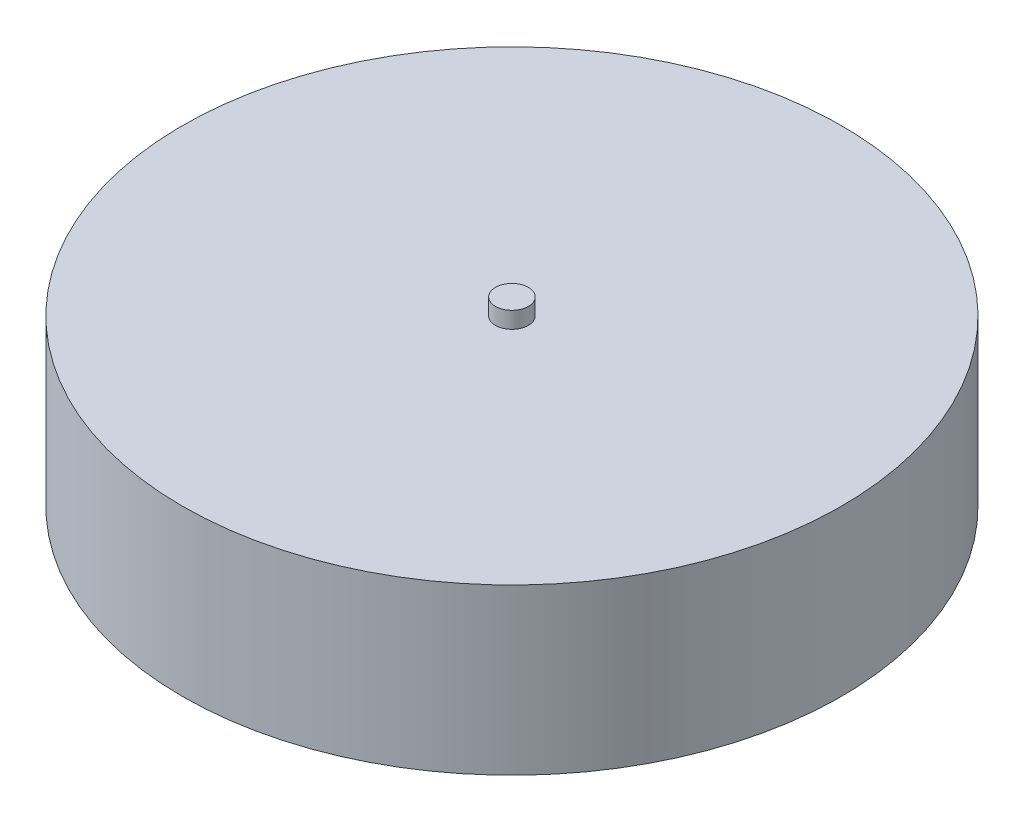
ISO-10303-21;
HEADER;
FILE_DESCRIPTION(('STEP AP214'),'2;1');
FILE_NAME('part.step','',(''),(''),'','','');
FILE_SCHEMA(('AUTOMOTIVE_DESIGN { 1 0 10303 214 1 1 1 1 }'));
ENDSEC;
DATA;
#1=APPLICATION_CONTEXT('core data for automotive mechanical design processes');
#2=APPLICATION_PROTOCOL_DEFINITION('international standard','automotive_design',2000,#1);
#3=PRODUCT_CONTEXT('',#1,'mechanical');
#4=PRODUCT('Part','Part','',(#3));
#5=PRODUCT_RELATED_PRODUCT_CATEGORY('part','',(#4));
#6=PRODUCT_DEFINITION_FORMATION('','',#4);
#7=PRODUCT_DEFINITION_CONTEXT('part definition',#1,'design');
#8=PRODUCT_DEFINITION('design','',#6,#7);
#9=PRODUCT_DEFINITION_SHAPE('','',#8);
#10=(LENGTH_UNIT() NAMED_UNIT(*) SI_UNIT(.MILLI.,.METRE.));
#11=(NAMED_UNIT(*) PLANE_ANGLE_UNIT() SI_UNIT($,.RADIAN.));
#12=(NAMED_UNIT(*) SI_UNIT($,.STERADIAN.) SOLID_ANGLE_UNIT());
#13=UNCERTAINTY_MEASURE_WITH_UNIT(LENGTH_MEASURE(1.E-05),#10,'distance_accuracy_value','');
#14=(GEOMETRIC_REPRESENTATION_CONTEXT(3) GLOBAL_UNCERTAINTY_ASSIGNED_CONTEXT((#13)) GLOBAL_UNIT_ASSIGNED_CONTEXT((#10,
#11,#12)) REPRESENTATION_CONTEXT('',''));
#15=CARTESIAN_POINT('',(0.,0.,0.));
#16=DIRECTION('',(0.,0.,1.));
#17=DIRECTION('',(1.,0.,0.));
#18=AXIS2_PLACEMENT_3D('',#15,#16,#17);
#19=CARTESIAN_POINT('',(0.,-10.,0.));
#20=DIRECTION('',(0.,1.,0.));
#21=DIRECTION('',(0.,0.,1.));
#22=AXIS2_PLACEMENT_3D('',#19,#20,#21);
#23=CYLINDRICAL_SURFACE('',#22,10.);
#24=CARTESIAN_POINT('',(0.,-10.,0.));
#25=DIRECTION('',(0.,1.,0.));
#26=DIRECTION('',(0.,0.,1.));
#27=AXIS2_PLACEMENT_3D('',#24,#25,#26);
#28=CIRCLE('',#27,10.);
#29=CARTESIAN_POINT('',(0.,-10.,10.));
#30=VERTEX_POINT('',#29);
#31=EDGE_CURVE('E11',#30,#30,#28,.T.);
#32=ORIENTED_EDGE('',*,*,#31,.T.);
#33=EDGE_LOOP('',(#32));
#34=FACE_BOUND('',#33,.T.);
#35=CARTESIAN_POINT('',(0.,110.,0.));
#36=DIRECTION('',(0.,1.,0.));
#37=DIRECTION('',(0.,0.,1.));
#38=AXIS2_PLACEMENT_3D('',#35,#36,#37);
#39=CIRCLE('',#38,10.);
#40=CARTESIAN_POINT('',(0.,110.,10.));
#41=VERTEX_POINT('',#40);
#42=EDGE_CURVE('E55',#41,#41,#39,.T.);
#43=ORIENTED_EDGE('',*,*,#42,.F.);
#44=EDGE_LOOP('',(#43));
#45=FACE_BOUND('',#44,.T.);
#46=ADVANCED_FACE('F49',(#34,#45),#23,.T.);
#47=CARTESIAN_POINT('',(0.,-10.,0.));
#48=DIRECTION('',(0.,1.,0.));
#49=DIRECTION('',(0.,0.,1.));
#50=AXIS2_PLACEMENT_3D('',#47,#48,#49);
#51=PLANE('',#50);
#52=ORIENTED_EDGE('',*,*,#31,.F.);
#53=EDGE_LOOP('',(#52));
#54=FACE_BOUND('',#53,.T.);
#55=ADVANCED_FACE('F64',(#54),#51,.F.);
#56=CARTESIAN_POINT('',(0.,110.,0.));
#57=DIRECTION('',(0.,1.,0.));
#58=DIRECTION('',(0.,0.,1.));
#59=AXIS2_PLACEMENT_3D('',#56,#57,#58);
#60=PLANE('',#59);
#61=ORIENTED_EDGE('',*,*,#42,.T.);
#62=EDGE_LOOP('',(#61));
#63=FACE_BOUND('',#62,.T.);
#64=ADVANCED_FACE('F61',(#63),#60,.T.);
#65=CLOSED_SHELL('',(#46,#55,#64));
#66=MANIFOLD_SOLID_BREP('B2',#65);
#67=CARTESIAN_POINT('',(0.,100.,0.));
#68=DIRECTION('',(0.,-1.,0.));
#69=DIRECTION('',(0.,0.,-1.));
#70=AXIS2_PLACEMENT_3D('',#67,#68,#69);
#71=CYLINDRICAL_SURFACE('',#70,200.);
#72=CARTESIAN_POINT('',(0.,100.,0.));
#73=DIRECTION('',(0.,1.,0.));
#74=DIRECTION('',(0.,0.,1.));
#75=AXIS2_PLACEMENT_3D('',#72,#73,#74);
#76=CIRCLE('',#75,200.);
#77=CARTESIAN_POINT('',(0.,100.,200.));
#78=VERTEX_POINT('',#77);
#79=EDGE_CURVE('E48',#78,#78,#76,.T.);
#80=ORIENTED_EDGE('',*,*,#79,.F.);
#81=EDGE_LOOP('',(#80));
#82=FACE_BOUND('',#81,.T.);
#83=CARTESIAN_POINT('',(0.,0.,0.));
#84=DIRECTION('',(0.,1.,0.));
#85=DIRECTION('',(0.,0.,1.));
#86=AXIS2_PLACEMENT_3D('',#83,#84,#85);
#87=CIRCLE('',#86,200.);
#88=CARTESIAN_POINT('',(0.,0.,200.));
#89=VERTEX_POINT('',#88);
#90=EDGE_CURVE('E96',#89,#89,#87,.T.);
#91=ORIENTED_EDGE('',*,*,#90,.T.);
#92=EDGE_LOOP('',(#91));
#93=FACE_BOUND('',#92,.T.);
#94=ADVANCED_FACE('F93',(#82,#93),#71,.T.);
#95=CARTESIAN_POINT('',(0.,100.,0.));
#96=DIRECTION('',(0.,1.,0.));
#97=DIRECTION('',(0.,0.,1.));
#98=AXIS2_PLACEMENT_3D('',#95,#96,#97);
#99=PLANE('',#98);
#100=ORIENTED_EDGE('',*,*,#79,.T.);
#101=EDGE_LOOP('',(#100));
#102=FACE_BOUND('',#101,.T.);
#103=ADVANCED_FACE('F108',(#102),#99,.T.);
#104=CARTESIAN_POINT('',(0.,0.,0.));
#105=DIRECTION('',(0.,1.,0.));
#106=DIRECTION('',(0.,0.,1.));
#107=AXIS2_PLACEMENT_3D('',#104,#105,#106);
#108=PLANE('',#107);
#109=ORIENTED_EDGE('',*,*,#90,.F.);
#110=EDGE_LOOP('',(#109));
#111=FACE_BOUND('',#110,.T.);
#112=ADVANCED_FACE('F106',(#111),#108,.F.);
#113=CLOSED_SHELL('',(#94,#103,#112));
#114=MANIFOLD_SOLID_BREP('B6',#113);
#115=ADVANCED_BREP_SHAPE_REPRESENTATION('',(#18,#66,#114),#14);
#116=SHAPE_DEFINITION_REPRESENTATION(#9,#115);
ENDSEC;
END-ISO-10303-21;
